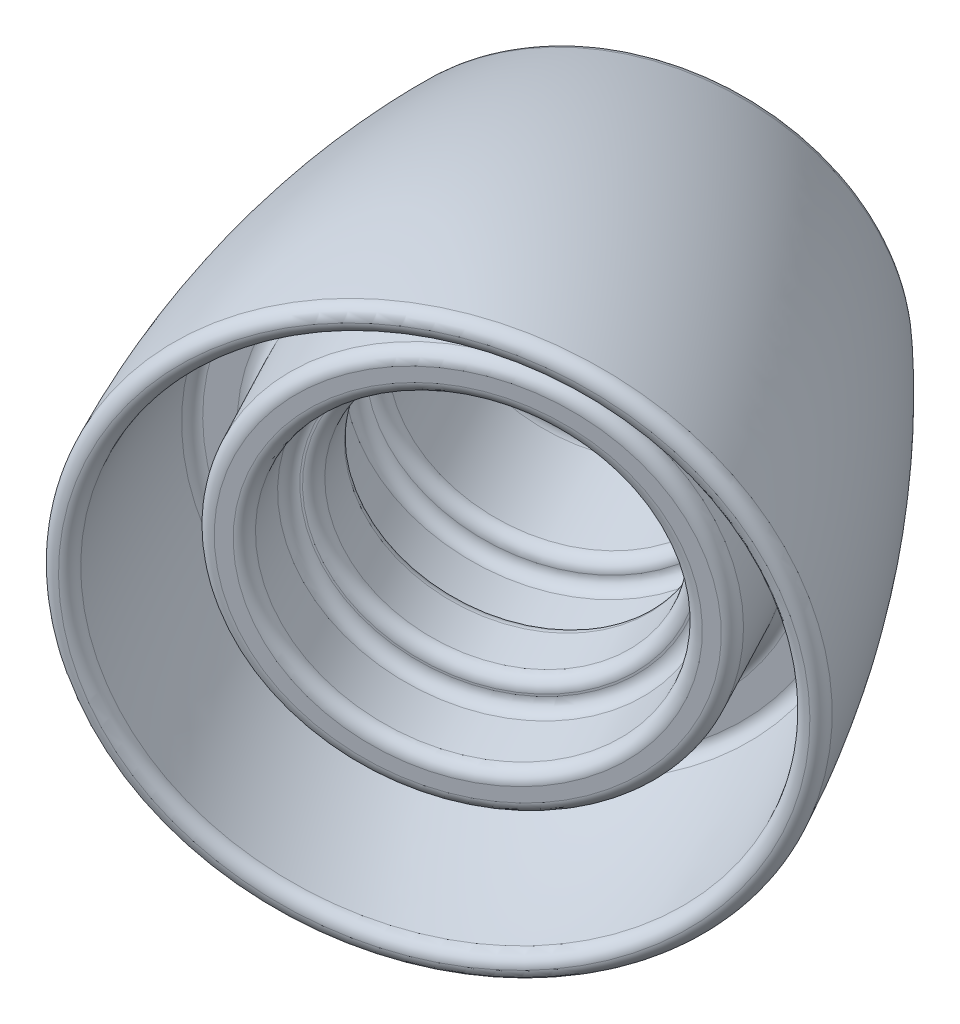
ISO-10303-21;
HEADER;
FILE_DESCRIPTION(('STEP AP214'),'2;1');
FILE_NAME('part.step','',(''),(''),'','','');
FILE_SCHEMA(('AUTOMOTIVE_DESIGN { 1 0 10303 214 1 1 1 1 }'));
ENDSEC;
DATA;
#1=APPLICATION_CONTEXT('core data for automotive mechanical design processes');
#2=APPLICATION_PROTOCOL_DEFINITION('international standard','automotive_design',2000,#1);
#3=PRODUCT_CONTEXT('',#1,'mechanical');
#4=PRODUCT('Part','Part','',(#3));
#5=PRODUCT_RELATED_PRODUCT_CATEGORY('part','',(#4));
#6=PRODUCT_DEFINITION_FORMATION('','',#4);
#7=PRODUCT_DEFINITION_CONTEXT('part definition',#1,'design');
#8=PRODUCT_DEFINITION('design','',#6,#7);
#9=PRODUCT_DEFINITION_SHAPE('','',#8);
#10=(LENGTH_UNIT() NAMED_UNIT(*) SI_UNIT(.MILLI.,.METRE.));
#11=(NAMED_UNIT(*) PLANE_ANGLE_UNIT() SI_UNIT($,.RADIAN.));
#12=(NAMED_UNIT(*) SI_UNIT($,.STERADIAN.) SOLID_ANGLE_UNIT());
#13=UNCERTAINTY_MEASURE_WITH_UNIT(LENGTH_MEASURE(1.E-05),#10,'distance_accuracy_value','');
#14=(GEOMETRIC_REPRESENTATION_CONTEXT(3) GLOBAL_UNCERTAINTY_ASSIGNED_CONTEXT((#13)) GLOBAL_UNIT_ASSIGNED_CONTEXT((#10,
#11,#12)) REPRESENTATION_CONTEXT('',''));
#15=CARTESIAN_POINT('',(0.,0.,0.));
#16=DIRECTION('',(0.,0.,1.));
#17=DIRECTION('',(1.,0.,0.));
#18=AXIS2_PLACEMENT_3D('',#15,#16,#17);
#19=CARTESIAN_POINT('',(-1.82840361063117,-8.23663197239245,23.7918539048536));
#20=DIRECTION('',(0.453212083113773,-0.0300186712748522,0.890897124866035));
#21=DIRECTION('',(-0.41626094218873,-0.890897124866035,0.181739211271491));
#22=AXIS2_PLACEMENT_3D('',#19,#20,#21);
#23=CYLINDRICAL_SURFACE('',#22,3.24582561371548);
#24=CARTESIAN_POINT('',(-6.10445961480962,-7.95340580891422,15.3862395317425));
#25=DIRECTION('',(0.453212083113773,-0.0300186712748522,0.890897124866035));
#26=DIRECTION('',(-0.41626094218873,-0.890897124866035,0.181739211271491));
#27=AXIS2_PLACEMENT_3D('',#24,#25,#26);
#28=CIRCLE('',#27,3.24582561371548);
#29=CARTESIAN_POINT('',(-7.45557004295514,-10.8451025159899,15.976133318704));
#30=VERTEX_POINT('',#29);
#31=EDGE_CURVE('E89',#30,#30,#28,.F.);
#32=ORIENTED_EDGE('',*,*,#31,.T.);
#33=EDGE_LOOP('',(#32));
#34=FACE_BOUND('',#33,.T.);
#35=CARTESIAN_POINT('',(-5.60592632338447,-7.98642634731656,16.3662263690952));
#36=DIRECTION('',(-0.453212083113773,0.0300186712748522,-0.890897124866035));
#37=DIRECTION('',(0.41626094218873,0.890897124866035,-0.181739211271491));
#38=AXIS2_PLACEMENT_3D('',#35,#36,#37);
#39=CIRCLE('',#38,3.24582561371548);
#40=CARTESIAN_POINT('',(-4.25481589523895,-5.0947296402409,15.7763325821337));
#41=VERTEX_POINT('',#40);
#42=EDGE_CURVE('E92',#41,#41,#39,.F.);
#43=ORIENTED_EDGE('',*,*,#42,.T.);
#44=EDGE_LOOP('',(#43));
#45=FACE_BOUND('',#44,.T.);
#46=ADVANCED_FACE('F30',(#34,#45),#23,.F.);
#47=CARTESIAN_POINT('',(-4.36631390040934,-5.58336181099489,16.0972048205766));
#48=DIRECTION('',(-0.453212083113773,0.0300186712748522,-0.890897124866035));
#49=DIRECTION('',(0.41626094218873,0.890897124866035,-0.181739211271491));
#50=AXIS2_PLACEMENT_3D('',#47,#48,#49);
#51=PLANE('',#50);
#52=CARTESIAN_POINT('',(-5.49262330260603,-7.99393101513527,16.5889506503117));
#53=DIRECTION('',(-0.453212083113773,0.0300186712748522,-0.890897124866035));
#54=DIRECTION('',(0.41626094218873,0.890897124866035,-0.181739211271491));
#55=AXIS2_PLACEMENT_3D('',#52,#53,#54);
#56=CIRCLE('',#55,2.99582561371548);
#57=CARTESIAN_POINT('',(-4.24557811000769,-5.32495858927612,16.0444916661681));
#58=VERTEX_POINT('',#57);
#59=EDGE_CURVE('E83',#58,#58,#56,.T.);
#60=ORIENTED_EDGE('',*,*,#59,.T.);
#61=EDGE_LOOP('',(#60));
#62=FACE_BOUND('',#61,.T.);
#63=CARTESIAN_POINT('',(-5.49262330260603,-7.99393101513527,16.5889506503117));
#64=DIRECTION('',(-0.453212083113773,0.0300186712748522,-0.890897124866035));
#65=DIRECTION('',(0.41626094218873,0.890897124866035,-0.181739211271491));
#66=AXIS2_PLACEMENT_3D('',#63,#64,#65);
#67=CIRCLE('',#66,2.95577728545579);
#68=CARTESIAN_POINT('',(-4.26224866486216,-5.36063752977838,16.0517700177587));
#69=VERTEX_POINT('',#68);
#70=EDGE_CURVE('E86',#69,#69,#67,.F.);
#71=ORIENTED_EDGE('',*,*,#70,.T.);
#72=EDGE_LOOP('',(#71));
#73=FACE_BOUND('',#72,.T.);
#74=ADVANCED_FACE('F168',(#62,#73),#51,.T.);
#75=CARTESIAN_POINT('',(-1.82840361063117,-8.23663197239245,23.7918539048536));
#76=DIRECTION('',(0.453212083113773,-0.0300186712748522,0.890897124866035));
#77=DIRECTION('',(-0.41626094218873,-0.890897124866035,0.181739211271491));
#78=AXIS2_PLACEMENT_3D('',#75,#76,#77);
#79=CYLINDRICAL_SURFACE('',#78,2.70577728545579);
#80=CARTESIAN_POINT('',(-5.37932028182759,-8.00143568295398,16.8116749315282));
#81=DIRECTION('',(-0.453212083113773,0.0300186712748522,-0.890897124866035));
#82=DIRECTION('',(0.41626094218873,0.890897124866035,-0.181739211271491));
#83=AXIS2_PLACEMENT_3D('',#80,#81,#82);
#84=CIRCLE('',#83,2.70577728545579);
#85=CARTESIAN_POINT('',(-4.2530108796309,-5.5908664788136,16.3199291017931));
#86=VERTEX_POINT('',#85);
#87=EDGE_CURVE('E77',#86,#86,#84,.T.);
#88=ORIENTED_EDGE('',*,*,#87,.T.);
#89=EDGE_LOOP('',(#88));
#90=FACE_BOUND('',#89,.T.);
#91=CARTESIAN_POINT('',(-4.97142940702519,-8.02845248710135,17.6134823439076));
#92=DIRECTION('',(0.453212083113773,-0.0300186712748522,0.890897124866035));
#93=DIRECTION('',(-0.41626094218873,-0.890897124866035,0.181739211271491));
#94=AXIS2_PLACEMENT_3D('',#91,#92,#93);
#95=CIRCLE('',#94,2.70577728545579);
#96=CARTESIAN_POINT('',(-6.09773880922188,-10.4390216912417,18.1052281736427));
#97=VERTEX_POINT('',#96);
#98=EDGE_CURVE('E80',#97,#97,#95,.T.);
#99=ORIENTED_EDGE('',*,*,#98,.T.);
#100=EDGE_LOOP('',(#99));
#101=FACE_BOUND('',#100,.T.);
#102=ADVANCED_FACE('F164',(#90,#101),#79,.F.);
#103=CARTESIAN_POINT('',(-3.73181698405006,-5.62538795077968,17.3444607953891));
#104=DIRECTION('',(0.453212083113773,-0.0300186712748522,0.890897124866035));
#105=DIRECTION('',(-0.41626094218873,-0.890897124866035,0.181739211271491));
#106=AXIS2_PLACEMENT_3D('',#103,#104,#105);
#107=PLANE('',#106);
#108=CARTESIAN_POINT('',(-4.85812638624674,-8.03595715492006,17.8362066251241));
#109=DIRECTION('',(0.453212083113773,-0.0300186712748522,0.890897124866035));
#110=DIRECTION('',(-0.41626094218873,-0.890897124866035,0.181739211271491));
#111=AXIS2_PLACEMENT_3D('',#108,#109,#110);
#112=CIRCLE('',#111,2.95577728545579);
#113=CARTESIAN_POINT('',(-6.08850102399062,-10.669250640277,18.373387257677));
#114=VERTEX_POINT('',#113);
#115=EDGE_CURVE('E71',#114,#114,#112,.F.);
#116=ORIENTED_EDGE('',*,*,#115,.T.);
#117=EDGE_LOOP('',(#116));
#118=FACE_BOUND('',#117,.T.);
#119=CARTESIAN_POINT('',(-4.85812638624674,-8.03595715492006,17.8362066251241));
#120=DIRECTION('',(0.453212083113773,-0.0300186712748522,0.890897124866035));
#121=DIRECTION('',(-0.41626094218873,-0.890897124866035,0.181739211271491));
#122=AXIS2_PLACEMENT_3D('',#119,#120,#121);
#123=CIRCLE('',#122,2.99582561371548);
#124=CARTESIAN_POINT('',(-6.10517157884508,-10.7049295807792,18.3806656092677));
#125=VERTEX_POINT('',#124);
#126=EDGE_CURVE('E74',#125,#125,#123,.T.);
#127=ORIENTED_EDGE('',*,*,#126,.T.);
#128=EDGE_LOOP('',(#127));
#129=FACE_BOUND('',#128,.T.);
#130=ADVANCED_FACE('F160',(#118,#129),#107,.T.);
#131=CARTESIAN_POINT('',(-1.82840361063117,-8.23663197239245,23.7918539048536));
#132=DIRECTION('',(0.453212083113773,-0.0300186712748522,0.890897124866035));
#133=DIRECTION('',(-0.41626094218873,-0.890897124866035,0.181739211271491));
#134=AXIS2_PLACEMENT_3D('',#131,#132,#133);
#135=CYLINDRICAL_SURFACE('',#134,3.24582561371548);
#136=CARTESIAN_POINT('',(-4.7448233654683,-8.04346182273878,18.0589309063406));
#137=DIRECTION('',(0.453212083113773,-0.0300186712748522,0.890897124866035));
#138=DIRECTION('',(-0.41626094218873,-0.890897124866035,0.181739211271491));
#139=AXIS2_PLACEMENT_3D('',#136,#137,#138);
#140=CIRCLE('',#139,3.24582561371548);
#141=CARTESIAN_POINT('',(-6.09593379361382,-10.9351585298144,18.6488246933021));
#142=VERTEX_POINT('',#141);
#143=EDGE_CURVE('E65',#142,#142,#140,.F.);
#144=ORIENTED_EDGE('',*,*,#143,.T.);
#145=EDGE_LOOP('',(#144));
#146=FACE_BOUND('',#145,.T.);
#147=CARTESIAN_POINT('',(-4.2853736463624,-8.07389364615885,18.9620896018452));
#148=DIRECTION('',(0.453212083113773,-0.0300186712748522,0.890897124866035));
#149=DIRECTION('',(-0.41626094218873,-0.890897124866035,0.181739211271491));
#150=AXIS2_PLACEMENT_3D('',#147,#148,#149);
#151=CIRCLE('',#150,3.24582561371548);
#152=CARTESIAN_POINT('',(-5.63648407450792,-10.9655903532345,19.5519833888067));
#153=VERTEX_POINT('',#152);
#154=EDGE_CURVE('E68',#153,#153,#151,.T.);
#155=ORIENTED_EDGE('',*,*,#154,.T.);
#156=EDGE_LOOP('',(#155));
#157=FACE_BOUND('',#156,.T.);
#158=ADVANCED_FACE('F156',(#146,#157),#135,.F.);
#159=CARTESIAN_POINT('',(-2.82096019743843,-5.18970160690191,18.5949200961003));
#160=DIRECTION('',(0.453212083113773,-0.0300186712748522,0.890897124866035));
#161=DIRECTION('',(-0.41626094218873,-0.890897124866035,0.181739211271491));
#162=AXIS2_PLACEMENT_3D('',#159,#160,#161);
#163=PLANE('',#162);
#164=CARTESIAN_POINT('',(-4.17207062558395,-8.08139831397756,19.1848138830617));
#165=DIRECTION('',(0.453212083113773,-0.0300186712748522,0.890897124866035));
#166=DIRECTION('',(-0.41626094218873,-0.890897124866035,0.181739211271491));
#167=AXIS2_PLACEMENT_3D('',#164,#165,#166);
#168=CIRCLE('',#167,3.49582561371548);
#169=CARTESIAN_POINT('',(-5.62724628927666,-11.1958193022697,19.8201424728411));
#170=VERTEX_POINT('',#169);
#171=EDGE_CURVE('E45',#170,#170,#168,.F.);
#172=ORIENTED_EDGE('',*,*,#171,.T.);
#173=EDGE_LOOP('',(#172));
#174=FACE_BOUND('',#173,.T.);
#175=CARTESIAN_POINT('',(-4.17207062558395,-8.08139831397756,19.1848138830617));
#176=DIRECTION('',(0.453212083113773,-0.0300186712748522,0.890897124866035));
#177=DIRECTION('',(-0.41626094218873,-0.890897124866035,0.181739211271491));
#178=AXIS2_PLACEMENT_3D('',#175,#176,#177);
#179=CIRCLE('',#178,3.7785708845634);
#180=CARTESIAN_POINT('',(-5.74494210211922,-11.4477162511376,19.8715283753557));
#181=VERTEX_POINT('',#180);
#182=EDGE_CURVE('E50',#181,#181,#179,.T.);
#183=ORIENTED_EDGE('',*,*,#182,.T.);
#184=EDGE_LOOP('',(#183));
#185=FACE_BOUND('',#184,.T.);
#186=ADVANCED_FACE('F152',(#174,#185),#163,.T.);
#187=CARTESIAN_POINT('',(-1.82840361063117,-8.23663197239245,23.7918539048536));
#188=DIRECTION('',(0.453212083113773,-0.0300186712748522,0.890897124866035));
#189=DIRECTION('',(-0.41626094218873,-0.890897124866035,0.181739211271491));
#190=AXIS2_PLACEMENT_3D('',#187,#188,#189);
#191=CYLINDRICAL_SURFACE('',#190,4.0285708845634);
#192=CARTESIAN_POINT('',(-5.2320599834361,-8.01118952371409,17.1011503919848));
#193=DIRECTION('',(0.453212083113773,-0.0300186712748522,0.890897124866035));
#194=DIRECTION('',(-0.41626094218873,-0.890897124866035,0.181739211271491));
#195=AXIS2_PLACEMENT_3D('',#192,#193,#194);
#196=CIRCLE('',#195,4.0285708845634);
#197=CARTESIAN_POINT('',(-6.90899669551855,-11.6002317420906,17.8332996870967));
#198=VERTEX_POINT('',#197);
#199=EDGE_CURVE('E59',#198,#198,#196,.T.);
#200=ORIENTED_EDGE('',*,*,#199,.T.);
#201=EDGE_LOOP('',(#200));
#202=FACE_BOUND('',#201,.T.);
#203=CARTESIAN_POINT('',(-4.2853736463624,-8.07389364615885,18.9620896018452));
#204=DIRECTION('',(0.453212083113773,-0.0300186712748522,0.890897124866035));
#205=DIRECTION('',(-0.41626094218873,-0.890897124866035,0.181739211271491));
#206=AXIS2_PLACEMENT_3D('',#203,#204,#205);
#207=CIRCLE('',#206,4.0285708845634);
#208=CARTESIAN_POINT('',(-5.96231035844485,-11.6629358645354,19.6942388969571));
#209=VERTEX_POINT('',#208);
#210=EDGE_CURVE('E62',#209,#209,#207,.F.);
#211=ORIENTED_EDGE('',*,*,#210,.T.);
#212=EDGE_LOOP('',(#211));
#213=FACE_BOUND('',#212,.T.);
#214=ADVANCED_FACE('F148',(#202,#213),#191,.T.);
#215=CARTESIAN_POINT('',(-3.6684262921321,-4.41464263751882,16.1462768156565));
#216=DIRECTION('',(0.453212083113773,-0.0300186712748522,0.890897124866035));
#217=DIRECTION('',(-0.41626094218873,-0.890897124866035,0.181739211271491));
#218=AXIS2_PLACEMENT_3D('',#215,#216,#217);
#219=PLANE('',#218);
#220=CARTESIAN_POINT('',(-5.34536300421455,-8.00368485589538,16.8784261107683));
#221=DIRECTION('',(0.453212083113773,-0.0300186712748522,0.890897124866035));
#222=DIRECTION('',(-0.41626094218873,-0.890897124866035,0.181739211271491));
#223=AXIS2_PLACEMENT_3D('',#220,#221,#222);
#224=CIRCLE('',#223,4.2785708845634);
#225=CARTESIAN_POINT('',(-7.12636495184418,-11.8154513554884,17.656010208698));
#226=VERTEX_POINT('',#225);
#227=EDGE_CURVE('E53',#226,#226,#224,.F.);
#228=ORIENTED_EDGE('',*,*,#227,.T.);
#229=EDGE_LOOP('',(#228));
#230=FACE_BOUND('',#229,.T.);
#231=CARTESIAN_POINT('',(-5.34536300421455,-8.00368485589538,16.8784261107683));
#232=DIRECTION('',(0.453212083113773,-0.0300186712748522,0.890897124866035));
#233=DIRECTION('',(-0.41626094218873,-0.890897124866035,0.181739211271491));
#234=AXIS2_PLACEMENT_3D('',#231,#232,#233);
#235=CIRCLE('',#234,4.79273774166151);
#236=CARTESIAN_POINT('',(-7.34039253222205,-12.2735211301785,17.749454487769));
#237=VERTEX_POINT('',#236);
#238=EDGE_CURVE('E56',#237,#237,#235,.T.);
#239=ORIENTED_EDGE('',*,*,#238,.T.);
#240=EDGE_LOOP('',(#239));
#241=FACE_BOUND('',#240,.T.);
#242=ADVANCED_FACE('F144',(#230,#241),#219,.T.);
#243=CARTESIAN_POINT('',(-5.92820484945405,-4.55561842241409,12.0205937841695));
#244=CARTESIAN_POINT('',(-5.49588790536874,-4.33531117061553,12.5993762028067));
#245=CARTESIAN_POINT('',(-4.64271846800315,-3.95010381774628,13.7955572675327));
#246=CARTESIAN_POINT('',(-3.44076764867436,-3.5609253915247,15.6478758867091));
#247=CARTESIAN_POINT('',(-2.30642175990725,-3.35375627529409,17.5703422472452));
#248=CARTESIAN_POINT('',(-1.59087960974788,-3.33850083961202,18.9087010873886));
#249=CARTESIAN_POINT('',(-1.24880630666905,-3.36115630113467,19.5811262065507));
#250=B_SPLINE_CURVE_WITH_KNOTS('',3,(#243,#244,#245,#246,#247,#248,#249),.UNSPECIFIED.,.F.,.F.,
(4,1,1,1,4),(0.,0.25,0.5,0.75,1.),.UNSPECIFIED.);
#251=CARTESIAN_POINT('',(-1.82840361063117,-8.23663197239245,23.7918539048536));
#252=DIRECTION('',(0.453212083113773,-0.0300186712748522,0.890897124866035));
#253=AXIS1_PLACEMENT('',#251,#252);
#254=SURFACE_OF_REVOLUTION('',#250,#253);
#255=CARTESIAN_POINT('',(-5.25007855398893,-8.00999605697651,17.0657305669232));
#256=DIRECTION('',(0.453212083113773,-0.0300186712748522,0.890897124866035));
#257=DIRECTION('',(-0.41626094218873,-0.890897124866035,0.181739211271491));
#258=AXIS2_PLACEMENT_3D('',#255,#256,#257);
#259=CIRCLE('',#258,5.03955618251426);
#260=CARTESIAN_POINT('',(-7.34784895873535,-12.4997221705793,17.9816155326917));
#261=VERTEX_POINT('',#260);
#262=EDGE_CURVE('E41',#261,#261,#259,.F.);
#263=ORIENTED_EDGE('',*,*,#262,.T.);
#264=EDGE_LOOP('',(#263));
#265=FACE_BOUND('',#264,.T.);
#266=CARTESIAN_POINT('',(-3.58801419079784,-8.120083509662,20.3329169851139));
#267=DIRECTION('',(0.453212083113773,-0.0300186712748522,0.890897124866035));
#268=DIRECTION('',(-0.41626094218873,-0.890897124866035,0.181739211271491));
#269=AXIS2_PLACEMENT_3D('',#266,#267,#268);
#270=CIRCLE('',#269,5.34884288988972);
#271=CARTESIAN_POINT('',(-5.81452857176283,-12.8853522616249,21.3050114731376));
#272=VERTEX_POINT('',#271);
#273=EDGE_CURVE('E95',#272,#272,#270,.T.);
#274=ORIENTED_EDGE('',*,*,#273,.T.);
#275=EDGE_LOOP('',(#274));
#276=FACE_BOUND('',#275,.T.);
#277=ADVANCED_FACE('F140',(#265,#276),#254,.F.);
#278=CARTESIAN_POINT('',(-1.24880630666905,-3.36115630113467,19.5811262065507));
#279=DIRECTION('',(0.453212083113773,-0.0300186712748522,0.890897124866035));
#280=DIRECTION('',(-0.41626094218873,-0.890897124866035,0.181739211271491));
#281=AXIS2_PLACEMENT_3D('',#278,#279,#280);
#282=PLANE('',#281);
#283=CARTESIAN_POINT('',(-3.47582953274974,-8.12751410230836,20.5534428559655));
#284=DIRECTION('',(0.453212083113773,-0.0300186712748522,0.890897124866035));
#285=DIRECTION('',(-0.41626094218873,-0.890897124866035,0.181739211271491));
#286=AXIS2_PLACEMENT_3D('',#283,#284,#285);
#287=CIRCLE('',#286,5.59884535934687);
#288=CARTESIAN_POINT('',(-5.80641017720047,-13.11550933552,21.5709725956043));
#289=VERTEX_POINT('',#288);
#290=EDGE_CURVE('E101',#289,#289,#287,.T.);
#291=ORIENTED_EDGE('',*,*,#290,.T.);
#292=EDGE_LOOP('',(#291));
#293=FACE_BOUND('',#292,.T.);
#294=CARTESIAN_POINT('',(-3.47582953274974,-8.12751410230836,20.5534428559655));
#295=DIRECTION('',(0.453212083113773,-0.0300186712748522,0.890897124866035));
#296=DIRECTION('',(-0.41626094218873,-0.890897124866035,0.181739211271491));
#297=AXIS2_PLACEMENT_3D('',#294,#295,#296);
#298=CIRCLE('',#297,5.59883071113216);
#299=CARTESIAN_POINT('',(-5.80640407972081,-13.1154962854677,21.5709699334493));
#300=VERTEX_POINT('',#299);
#301=EDGE_CURVE('E104',#300,#300,#298,.F.);
#302=ORIENTED_EDGE('',*,*,#301,.T.);
#303=EDGE_LOOP('',(#302));
#304=FACE_BOUND('',#303,.T.);
#305=ADVANCED_FACE('F135',(#293,#304),#282,.T.);
#306=CARTESIAN_POINT('',(-1.04067583557468,-2.91570773870165,19.490256600915));
#307=CARTESIAN_POINT('',(-3.14957677211419,-2.7760238990073,15.3447056524892));
#308=CARTESIAN_POINT('',(-5.81525249230326,-4.13443398663146,11.7759105578051));
#309=B_SPLINE_CURVE_WITH_KNOTS('',2,(#306,#307,#308),.UNSPECIFIED.,.F.,.F.,(3,3),(0.,1.),.UNSPECIFIED.);
#310=CARTESIAN_POINT('',(-1.82840361063117,-8.23663197239245,23.7918539048536));
#311=DIRECTION('',(0.453212083113773,-0.0300186712748522,0.890897124866035));
#312=AXIS1_PLACEMENT('',#310,#311);
#313=SURFACE_OF_REVOLUTION('',#309,#312);
#314=CARTESIAN_POINT('',(-3.59023929192932,-8.11993612925907,20.3285430147931));
#315=DIRECTION('',(0.453212083113773,-0.0300186712748522,0.890897124866035));
#316=DIRECTION('',(-0.41626094218873,-0.890897124866035,0.181739211271491));
#317=AXIS2_PLACEMENT_3D('',#314,#315,#316);
#318=CIRCLE('',#317,5.84883343245303);
#319=CARTESIAN_POINT('',(-6.02488020722716,-13.3306450180518,21.3915053896654));
#320=VERTEX_POINT('',#319);
#321=EDGE_CURVE('E98',#320,#320,#318,.F.);
#322=ORIENTED_EDGE('',*,*,#321,.T.);
#323=EDGE_LOOP('',(#322));
#324=FACE_BOUND('',#323,.T.);
#325=CARTESIAN_POINT('',(-7.40659112230369,-7.86715864310271,12.8265875289676));
#326=DIRECTION('',(0.453212083113773,-0.0300186712748522,0.890897124866035));
#327=DIRECTION('',(-0.41626094218873,-0.890897124866035,0.181739211271491));
#328=AXIS2_PLACEMENT_3D('',#325,#326,#327);
#329=CIRCLE('',#328,4.30199098337212);
#330=CARTESIAN_POINT('',(-9.19734194232959,-11.6997900413885,13.6084279771828));
#331=VERTEX_POINT('',#330);
#332=EDGE_CURVE('E116',#331,#331,#329,.T.);
#333=ORIENTED_EDGE('',*,*,#332,.T.);
#334=EDGE_LOOP('',(#333));
#335=FACE_BOUND('',#334,.T.);
#336=ADVANCED_FACE('F130',(#324,#335),#313,.F.);
#337=CARTESIAN_POINT('',(-6.41002068975469,-5.40737896745309,12.0355859011746));
#338=DIRECTION('',(-0.453212083113773,0.0300186712748522,-0.890897124866035));
#339=DIRECTION('',(0.41626094218873,0.890897124866035,-0.181739211271491));
#340=AXIS2_PLACEMENT_3D('',#337,#338,#339);
#341=PLANE('',#340);
#342=CARTESIAN_POINT('',(-7.55473828077369,-7.85734606083469,12.5353687321712));
#343=DIRECTION('',(-0.453212083113773,0.0300186712748522,-0.890897124866035));
#344=DIRECTION('',(0.41626094218873,0.890897124866035,-0.181739211271491));
#345=AXIS2_PLACEMENT_3D('',#342,#343,#344);
#346=CIRCLE('',#345,3.83291702671831);
#347=CARTESIAN_POINT('',(-5.9592446279007,-4.44261130188127,11.8387774148664));
#348=VERTEX_POINT('',#347);
#349=EDGE_CURVE('E110',#348,#348,#346,.T.);
#350=ORIENTED_EDGE('',*,*,#349,.T.);
#351=EDGE_LOOP('',(#350));
#352=FACE_BOUND('',#351,.T.);
#353=CARTESIAN_POINT('',(-7.55473828077369,-7.85734606083469,12.5353687321712));
#354=DIRECTION('',(-0.453212083113773,0.0300186712748522,-0.890897124866035));
#355=DIRECTION('',(0.41626094218873,0.890897124866035,-0.181739211271491));
#356=AXIS2_PLACEMENT_3D('',#353,#354,#355);
#357=CIRCLE('',#356,3.25);
#358=CARTESIAN_POINT('',(-6.20189021866032,-4.96193040502008,11.9447162955389));
#359=VERTEX_POINT('',#358);
#360=EDGE_CURVE('E113',#359,#359,#357,.F.);
#361=ORIENTED_EDGE('',*,*,#360,.T.);
#362=EDGE_LOOP('',(#361));
#363=FACE_BOUND('',#362,.T.);
#364=ADVANCED_FACE('F134',(#352,#363),#341,.T.);
#365=CARTESIAN_POINT('',(-1.82840361063117,-8.23663197239245,23.7918539048536));
#366=DIRECTION('',(0.453212083113773,-0.0300186712748522,0.890897124866035));
#367=DIRECTION('',(-0.41626094218873,-0.890897124866035,0.181739211271491));
#368=AXIS2_PLACEMENT_3D('',#365,#366,#367);
#369=CYLINDRICAL_SURFACE('',#368,2.75);
#370=CARTESIAN_POINT('',(-6.33105775878134,-7.93839699637629,14.9408064939086));
#371=DIRECTION('',(-0.453212083113773,0.0300186712748522,-0.890897124866035));
#372=DIRECTION('',(0.41626094218873,0.890897124866035,-0.181739211271491));
#373=AXIS2_PLACEMENT_3D('',#370,#371,#372);
#374=CIRCLE('',#373,2.75);
#375=CARTESIAN_POINT('',(-5.18634016776234,-5.48842990299469,14.441023662912));
#376=VERTEX_POINT('',#375);
#377=EDGE_CURVE('E37',#376,#376,#374,.F.);
#378=ORIENTED_EDGE('',*,*,#377,.T.);
#379=EDGE_LOOP('',(#378));
#380=FACE_BOUND('',#379,.T.);
#381=CARTESIAN_POINT('',(-7.32813223921681,-7.87235539647212,12.9808172946042));
#382=DIRECTION('',(-0.453212083113773,0.0300186712748522,-0.890897124866035));
#383=DIRECTION('',(0.41626094218873,0.890897124866035,-0.181739211271491));
#384=AXIS2_PLACEMENT_3D('',#381,#382,#383);
#385=CIRCLE('',#384,2.75);
#386=CARTESIAN_POINT('',(-6.1834146481978,-5.42238830309052,12.4810344636076));
#387=VERTEX_POINT('',#386);
#388=EDGE_CURVE('E107',#387,#387,#385,.T.);
#389=ORIENTED_EDGE('',*,*,#388,.T.);
#390=EDGE_LOOP('',(#389));
#391=FACE_BOUND('',#390,.T.);
#392=ADVANCED_FACE('F180',(#380,#391),#369,.F.);
#393=CARTESIAN_POINT('',(-7.32813223921681,-7.87235539647212,12.9808172946042));
#394=DIRECTION('',(0.453212083113773,-0.0300186712748522,0.890897124866035));
#395=DIRECTION('',(-0.41626094218873,-0.890897124866035,0.181739211271491));
#396=AXIS2_PLACEMENT_3D('',#393,#394,#395);
#397=TOROIDAL_SURFACE('',#396,3.83291702671831,0.5);
#398=ORIENTED_EDGE('',*,*,#349,.F.);
#399=EDGE_LOOP('',(#398));
#400=FACE_BOUND('',#399,.T.);
#401=ORIENTED_EDGE('',*,*,#332,.F.);
#402=EDGE_LOOP('',(#401));
#403=FACE_BOUND('',#402,.T.);
#404=ADVANCED_FACE('F176',(#400,#403),#397,.T.);
#405=CARTESIAN_POINT('',(-7.32813223921681,-7.87235539647212,12.9808172946042));
#406=DIRECTION('',(-0.453212083113773,0.0300186712748522,-0.890897124866035));
#407=DIRECTION('',(0.41626094218873,0.890897124866035,-0.181739211271491));
#408=AXIS2_PLACEMENT_3D('',#405,#406,#407);
#409=TOROIDAL_SURFACE('',#408,3.25,0.5);
#410=ORIENTED_EDGE('',*,*,#388,.F.);
#411=EDGE_LOOP('',(#410));
#412=FACE_BOUND('',#411,.T.);
#413=ORIENTED_EDGE('',*,*,#360,.F.);
#414=EDGE_LOOP('',(#413));
#415=FACE_BOUND('',#414,.T.);
#416=ADVANCED_FACE('F179',(#412,#415),#409,.T.);
#417=CARTESIAN_POINT('',(-3.58913255352816,-8.12000943448965,20.330718574749));
#418=DIRECTION('',(0.453212083113773,-0.0300186712748522,0.890897124866035));
#419=DIRECTION('',(-0.41626094218873,-0.890897124866035,0.181739211271491));
#420=AXIS2_PLACEMENT_3D('',#417,#418,#419);
#421=TOROIDAL_SURFACE('',#420,5.59884535934687,0.25);
#422=ORIENTED_EDGE('',*,*,#321,.F.);
#423=EDGE_LOOP('',(#422));
#424=FACE_BOUND('',#423,.T.);
#425=ORIENTED_EDGE('',*,*,#290,.F.);
#426=EDGE_LOOP('',(#425));
#427=FACE_BOUND('',#426,.T.);
#428=ADVANCED_FACE('F184',(#424,#427),#421,.T.);
#429=CARTESIAN_POINT('',(-3.58913255352818,-8.12000943448965,20.330718574749));
#430=DIRECTION('',(0.453212083113773,-0.0300186712748522,0.890897124866035));
#431=DIRECTION('',(-0.41626094218873,-0.890897124866035,0.181739211271491));
#432=AXIS2_PLACEMENT_3D('',#429,#430,#431);
#433=TOROIDAL_SURFACE('',#432,5.59883071113216,0.25);
#434=ORIENTED_EDGE('',*,*,#301,.F.);
#435=EDGE_LOOP('',(#434));
#436=FACE_BOUND('',#435,.T.);
#437=ORIENTED_EDGE('',*,*,#273,.F.);
#438=EDGE_LOOP('',(#437));
#439=FACE_BOUND('',#438,.T.);
#440=ADVANCED_FACE('F188',(#436,#439),#433,.T.);
#441=CARTESIAN_POINT('',(-6.10445961480962,-7.95340580891422,15.3862395317425));
#442=DIRECTION('',(0.453212083113773,-0.0300186712748522,0.890897124866035));
#443=DIRECTION('',(-0.41626094218873,-0.890897124866035,0.181739211271491));
#444=AXIS2_PLACEMENT_3D('',#441,#442,#443);
#445=TOROIDAL_SURFACE('',#444,2.99582561371548,0.25);
#446=CARTESIAN_POINT('',(-6.21775868682538,-7.94590140264327,15.1635230127668));
#447=DIRECTION('',(0.453212083113773,-0.0300186712748522,0.890897124866035));
#448=DIRECTION('',(-0.41626094218873,-0.890897124866035,0.181739211271491));
#449=AXIS2_PLACEMENT_3D('',#446,#447,#448);
#450=CIRCLE('',#449,2.99791280685829);
#451=CARTESIAN_POINT('',(-7.46567269640788,-10.6167333028724,15.7083613217459));
#452=VERTEX_POINT('',#451);
#453=EDGE_CURVE('E10',#452,#452,#450,.F.);
#454=ORIENTED_EDGE('',*,*,#453,.T.);
#455=EDGE_LOOP('',(#454));
#456=FACE_BOUND('',#455,.T.);
#457=ORIENTED_EDGE('',*,*,#31,.F.);
#458=EDGE_LOOP('',(#457));
#459=FACE_BOUND('',#458,.T.);
#460=ADVANCED_FACE('F192',(#456,#459),#445,.F.);
#461=CARTESIAN_POINT('',(-5.60592632338447,-7.98642634731656,16.3662263690952));
#462=DIRECTION('',(-0.453212083113773,0.0300186712748522,-0.890897124866035));
#463=DIRECTION('',(0.41626094218873,0.890897124866035,-0.181739211271491));
#464=AXIS2_PLACEMENT_3D('',#461,#462,#463);
#465=TOROIDAL_SURFACE('',#464,2.99582561371548,0.25);
#466=ORIENTED_EDGE('',*,*,#59,.F.);
#467=EDGE_LOOP('',(#466));
#468=FACE_BOUND('',#467,.T.);
#469=ORIENTED_EDGE('',*,*,#42,.F.);
#470=EDGE_LOOP('',(#469));
#471=FACE_BOUND('',#470,.T.);
#472=ADVANCED_FACE('F196',(#468,#471),#465,.F.);
#473=CARTESIAN_POINT('',(-5.37932028182759,-8.00143568295398,16.8116749315282));
#474=DIRECTION('',(-0.453212083113773,0.0300186712748522,-0.890897124866035));
#475=DIRECTION('',(0.41626094218873,0.890897124866035,-0.181739211271491));
#476=AXIS2_PLACEMENT_3D('',#473,#474,#475);
#477=TOROIDAL_SURFACE('',#476,2.95577728545579,0.25);
#478=ORIENTED_EDGE('',*,*,#87,.F.);
#479=EDGE_LOOP('',(#478));
#480=FACE_BOUND('',#479,.T.);
#481=ORIENTED_EDGE('',*,*,#70,.F.);
#482=EDGE_LOOP('',(#481));
#483=FACE_BOUND('',#482,.T.);
#484=ADVANCED_FACE('F199',(#480,#483),#477,.T.);
#485=CARTESIAN_POINT('',(-4.97142940702519,-8.02845248710135,17.6134823439076));
#486=DIRECTION('',(0.453212083113773,-0.0300186712748522,0.890897124866035));
#487=DIRECTION('',(-0.41626094218873,-0.890897124866035,0.181739211271491));
#488=AXIS2_PLACEMENT_3D('',#485,#486,#487);
#489=TOROIDAL_SURFACE('',#488,2.95577728545579,0.25);
#490=ORIENTED_EDGE('',*,*,#115,.F.);
#491=EDGE_LOOP('',(#490));
#492=FACE_BOUND('',#491,.T.);
#493=ORIENTED_EDGE('',*,*,#98,.F.);
#494=EDGE_LOOP('',(#493));
#495=FACE_BOUND('',#494,.T.);
#496=ADVANCED_FACE('F203',(#492,#495),#489,.T.);
#497=CARTESIAN_POINT('',(-4.7448233654683,-8.04346182273878,18.0589309063406));
#498=DIRECTION('',(0.453212083113773,-0.0300186712748522,0.890897124866035));
#499=DIRECTION('',(-0.41626094218873,-0.890897124866035,0.181739211271491));
#500=AXIS2_PLACEMENT_3D('',#497,#498,#499);
#501=TOROIDAL_SURFACE('',#500,2.99582561371548,0.25);
#502=ORIENTED_EDGE('',*,*,#143,.F.);
#503=EDGE_LOOP('',(#502));
#504=FACE_BOUND('',#503,.T.);
#505=ORIENTED_EDGE('',*,*,#126,.F.);
#506=EDGE_LOOP('',(#505));
#507=FACE_BOUND('',#506,.T.);
#508=ADVANCED_FACE('F207',(#504,#507),#501,.F.);
#509=CARTESIAN_POINT('',(-5.2320599834361,-8.01118952371409,17.1011503919848));
#510=DIRECTION('',(0.453212083113773,-0.0300186712748522,0.890897124866035));
#511=DIRECTION('',(-0.41626094218873,-0.890897124866035,0.181739211271491));
#512=AXIS2_PLACEMENT_3D('',#509,#510,#511);
#513=TOROIDAL_SURFACE('',#512,4.2785708845634,0.25);
#514=ORIENTED_EDGE('',*,*,#227,.F.);
#515=EDGE_LOOP('',(#514));
#516=FACE_BOUND('',#515,.T.);
#517=ORIENTED_EDGE('',*,*,#199,.F.);
#518=EDGE_LOOP('',(#517));
#519=FACE_BOUND('',#518,.T.);
#520=ADVANCED_FACE('F211',(#516,#519),#513,.F.);
#521=CARTESIAN_POINT('',(-4.2853736463624,-8.07389364615885,18.9620896018452));
#522=DIRECTION('',(0.453212083113773,-0.0300186712748522,0.890897124866035));
#523=DIRECTION('',(-0.41626094218873,-0.890897124866035,0.181739211271491));
#524=AXIS2_PLACEMENT_3D('',#521,#522,#523);
#525=TOROIDAL_SURFACE('',#524,3.49582561371548,0.25);
#526=ORIENTED_EDGE('',*,*,#171,.F.);
#527=EDGE_LOOP('',(#526));
#528=FACE_BOUND('',#527,.T.);
#529=ORIENTED_EDGE('',*,*,#154,.F.);
#530=EDGE_LOOP('',(#529));
#531=FACE_BOUND('',#530,.T.);
#532=ADVANCED_FACE('F215',(#528,#531),#525,.T.);
#533=CARTESIAN_POINT('',(-4.2853736463624,-8.07389364615885,18.9620896018452));
#534=DIRECTION('',(0.453212083113773,-0.0300186712748522,0.890897124866035));
#535=DIRECTION('',(-0.41626094218873,-0.890897124866035,0.181739211271491));
#536=AXIS2_PLACEMENT_3D('',#533,#534,#535);
#537=TOROIDAL_SURFACE('',#536,3.7785708845634,0.25);
#538=ORIENTED_EDGE('',*,*,#210,.F.);
#539=EDGE_LOOP('',(#538));
#540=FACE_BOUND('',#539,.T.);
#541=ORIENTED_EDGE('',*,*,#182,.F.);
#542=EDGE_LOOP('',(#541));
#543=FACE_BOUND('',#542,.T.);
#544=ADVANCED_FACE('F219',(#540,#543),#537,.T.);
#545=CARTESIAN_POINT('',(-5.23205998343608,-8.01118952371409,17.1011503919849));
#546=DIRECTION('',(0.453212083113773,-0.0300186712748522,0.890897124866035));
#547=DIRECTION('',(-0.41626094218873,-0.890897124866035,0.181739211271491));
#548=AXIS2_PLACEMENT_3D('',#545,#546,#547);
#549=TOROIDAL_SURFACE('',#548,4.79273774166151,0.25);
#550=ORIENTED_EDGE('',*,*,#262,.F.);
#551=EDGE_LOOP('',(#550));
#552=FACE_BOUND('',#551,.T.);
#553=ORIENTED_EDGE('',*,*,#238,.F.);
#554=EDGE_LOOP('',(#553));
#555=FACE_BOUND('',#554,.T.);
#556=ADVANCED_FACE('F222',(#552,#555),#549,.F.);
#557=CARTESIAN_POINT('',(-6.33105775878134,-7.93839699637629,14.9408064939086));
#558=DIRECTION('',(-0.453212083113773,0.0300186712748522,-0.890897124866035));
#559=DIRECTION('',(0.41626094218873,0.890897124866035,-0.181739211271491));
#560=AXIS2_PLACEMENT_3D('',#557,#558,#559);
#561=TOROIDAL_SURFACE('',#560,3.,0.25);
#562=ORIENTED_EDGE('',*,*,#453,.F.);
#563=EDGE_LOOP('',(#562));
#564=FACE_BOUND('',#563,.T.);
#565=ORIENTED_EDGE('',*,*,#377,.F.);
#566=EDGE_LOOP('',(#565));
#567=FACE_BOUND('',#566,.T.);
#568=ADVANCED_FACE('F32',(#564,#567),#561,.T.);
#569=CLOSED_SHELL('',(#46,#74,#102,#130,#158,#186,#214,#242,#277,#305,#336,#364,#392,#404,#416,
#428,#440,#460,#472,#484,#496,#508,#520,#532,#544,#556,#568));
#570=MANIFOLD_SOLID_BREP('B2',#569);
#571=ADVANCED_BREP_SHAPE_REPRESENTATION('',(#18,#570),#14);
#572=SHAPE_DEFINITION_REPRESENTATION(#9,#571);
ENDSEC;
END-ISO-10303-21;
